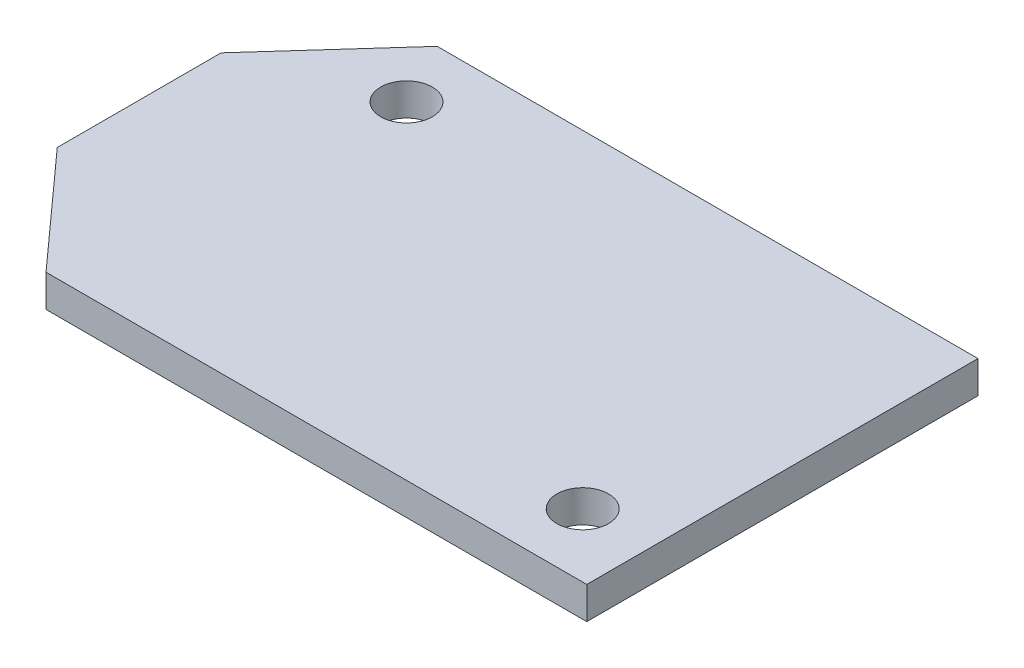
ISO-10303-21;
HEADER;
FILE_DESCRIPTION(('STEP AP214'),'2;1');
FILE_NAME('part.step','',(''),(''),'','','');
FILE_SCHEMA(('AUTOMOTIVE_DESIGN { 1 0 10303 214 1 1 1 1 }'));
ENDSEC;
DATA;
#1=APPLICATION_CONTEXT('core data for automotive mechanical design processes');
#2=APPLICATION_PROTOCOL_DEFINITION('international standard','automotive_design',2000,#1);
#3=PRODUCT_CONTEXT('',#1,'mechanical');
#4=PRODUCT('Part','Part','',(#3));
#5=PRODUCT_RELATED_PRODUCT_CATEGORY('part','',(#4));
#6=PRODUCT_DEFINITION_FORMATION('','',#4);
#7=PRODUCT_DEFINITION_CONTEXT('part definition',#1,'design');
#8=PRODUCT_DEFINITION('design','',#6,#7);
#9=PRODUCT_DEFINITION_SHAPE('','',#8);
#10=(LENGTH_UNIT() NAMED_UNIT(*) SI_UNIT(.MILLI.,.METRE.));
#11=(NAMED_UNIT(*) PLANE_ANGLE_UNIT() SI_UNIT($,.RADIAN.));
#12=(NAMED_UNIT(*) SI_UNIT($,.STERADIAN.) SOLID_ANGLE_UNIT());
#13=UNCERTAINTY_MEASURE_WITH_UNIT(LENGTH_MEASURE(1.E-05),#10,'distance_accuracy_value','');
#14=(GEOMETRIC_REPRESENTATION_CONTEXT(3) GLOBAL_UNCERTAINTY_ASSIGNED_CONTEXT((#13)) GLOBAL_UNIT_ASSIGNED_CONTEXT((#10,
#11,#12)) REPRESENTATION_CONTEXT('',''));
#15=CARTESIAN_POINT('',(0.,0.,0.));
#16=DIRECTION('',(0.,0.,1.));
#17=DIRECTION('',(1.,0.,0.));
#18=AXIS2_PLACEMENT_3D('',#15,#16,#17);
#19=CARTESIAN_POINT('',(0.,2.,0.));
#20=DIRECTION('',(0.,-1.,0.));
#21=DIRECTION('',(0.,0.,-1.));
#22=AXIS2_PLACEMENT_3D('',#19,#20,#21);
#23=PLANE('',#22);
#24=DIRECTION('',(0.,0.,-1.));
#25=VECTOR('',#24,1.);
#26=CARTESIAN_POINT('',(16.764,2.,12.1285));
#27=LINE('',#26,#25);
#28=CARTESIAN_POINT('',(16.764,2.,12.1285));
#29=VERTEX_POINT('',#28);
#30=CARTESIAN_POINT('',(16.764,2.,-12.1285));
#31=VERTEX_POINT('',#30);
#32=EDGE_CURVE('E146',#29,#31,#27,.T.);
#33=ORIENTED_EDGE('',*,*,#32,.T.);
#34=DIRECTION('',(-1.,0.,0.));
#35=VECTOR('',#34,1.);
#36=CARTESIAN_POINT('',(-16.764,2.,-12.1285));
#37=LINE('',#36,#35);
#38=CARTESIAN_POINT('',(-16.764,2.,-12.1285));
#39=VERTEX_POINT('',#38);
#40=EDGE_CURVE('E94',#31,#39,#37,.T.);
#41=ORIENTED_EDGE('',*,*,#40,.T.);
#42=DIRECTION('',(-0.669334446868794,0.,0.742961236024361));
#43=VECTOR('',#42,1.);
#44=CARTESIAN_POINT('',(-23.114,2.,-5.08));
#45=LINE('',#44,#43);
#46=CARTESIAN_POINT('',(-23.114,2.,-5.08));
#47=VERTEX_POINT('',#46);
#48=EDGE_CURVE('E107',#39,#47,#45,.T.);
#49=ORIENTED_EDGE('',*,*,#48,.T.);
#50=DIRECTION('',(0.,0.,1.));
#51=VECTOR('',#50,1.);
#52=CARTESIAN_POINT('',(-23.114,2.,5.08));
#53=LINE('',#52,#51);
#54=CARTESIAN_POINT('',(-23.114,2.,5.08));
#55=VERTEX_POINT('',#54);
#56=EDGE_CURVE('E101',#47,#55,#53,.T.);
#57=ORIENTED_EDGE('',*,*,#56,.T.);
#58=DIRECTION('',(0.669334446868794,0.,0.742961236024361));
#59=VECTOR('',#58,1.);
#60=CARTESIAN_POINT('',(-23.114,2.,5.08));
#61=LINE('',#60,#59);
#62=CARTESIAN_POINT('',(-16.764,2.,12.1285));
#63=VERTEX_POINT('',#62);
#64=EDGE_CURVE('E105',#55,#63,#61,.T.);
#65=ORIENTED_EDGE('',*,*,#64,.T.);
#66=DIRECTION('',(1.,0.,0.));
#67=VECTOR('',#66,1.);
#68=CARTESIAN_POINT('',(-16.764,2.,12.1285));
#69=LINE('',#68,#67);
#70=EDGE_CURVE('E57',#63,#29,#69,.T.);
#71=ORIENTED_EDGE('',*,*,#70,.T.);
#72=EDGE_LOOP('',(#33,#41,#49,#57,#65,#71));
#73=FACE_BOUND('',#72,.T.);
#74=CARTESIAN_POINT('',(12.574,2.,8.1915));
#75=DIRECTION('',(0.,1.,0.));
#76=DIRECTION('',(0.,0.,1.));
#77=AXIS2_PLACEMENT_3D('',#74,#75,#76);
#78=CIRCLE('',#77,1.6);
#79=CARTESIAN_POINT('',(12.574,2.,9.7915));
#80=VERTEX_POINT('',#79);
#81=EDGE_CURVE('E134',#80,#80,#78,.T.);
#82=ORIENTED_EDGE('',*,*,#81,.F.);
#83=EDGE_LOOP('',(#82));
#84=FACE_BOUND('',#83,.T.);
#85=CARTESIAN_POINT('',(-14.732,2.,-8.1915));
#86=DIRECTION('',(0.,1.,0.));
#87=DIRECTION('',(0.,0.,1.));
#88=AXIS2_PLACEMENT_3D('',#85,#86,#87);
#89=CIRCLE('',#88,1.6);
#90=CARTESIAN_POINT('',(-14.732,2.,-6.5915));
#91=VERTEX_POINT('',#90);
#92=EDGE_CURVE('E191',#91,#91,#89,.T.);
#93=ORIENTED_EDGE('',*,*,#92,.F.);
#94=EDGE_LOOP('',(#93));
#95=FACE_BOUND('',#94,.T.);
#96=ADVANCED_FACE('F39',(#73,#84,#95),#23,.F.);
#97=CARTESIAN_POINT('',(0.,0.,0.));
#98=DIRECTION('',(0.,-1.,0.));
#99=DIRECTION('',(0.,0.,-1.));
#100=AXIS2_PLACEMENT_3D('',#97,#98,#99);
#101=PLANE('',#100);
#102=CARTESIAN_POINT('',(12.574,0.,8.1915));
#103=DIRECTION('',(0.,1.,0.));
#104=DIRECTION('',(0.,0.,1.));
#105=AXIS2_PLACEMENT_3D('',#102,#103,#104);
#106=CIRCLE('',#105,1.6);
#107=CARTESIAN_POINT('',(12.574,0.,9.7915));
#108=VERTEX_POINT('',#107);
#109=EDGE_CURVE('E198',#108,#108,#106,.T.);
#110=ORIENTED_EDGE('',*,*,#109,.T.);
#111=EDGE_LOOP('',(#110));
#112=FACE_BOUND('',#111,.T.);
#113=DIRECTION('',(0.,0.,-1.));
#114=VECTOR('',#113,1.);
#115=CARTESIAN_POINT('',(16.764,0.,12.1285));
#116=LINE('',#115,#114);
#117=CARTESIAN_POINT('',(16.764,0.,12.1285));
#118=VERTEX_POINT('',#117);
#119=CARTESIAN_POINT('',(16.764,0.,-12.1285));
#120=VERTEX_POINT('',#119);
#121=EDGE_CURVE('E129',#118,#120,#116,.T.);
#122=ORIENTED_EDGE('',*,*,#121,.F.);
#123=DIRECTION('',(1.,0.,0.));
#124=VECTOR('',#123,1.);
#125=CARTESIAN_POINT('',(-16.764,0.,12.1285));
#126=LINE('',#125,#124);
#127=CARTESIAN_POINT('',(-16.764,0.,12.1285));
#128=VERTEX_POINT('',#127);
#129=EDGE_CURVE('E86',#128,#118,#126,.T.);
#130=ORIENTED_EDGE('',*,*,#129,.F.);
#131=DIRECTION('',(0.669334446868794,0.,0.742961236024361));
#132=VECTOR('',#131,1.);
#133=CARTESIAN_POINT('',(-23.114,0.,5.08));
#134=LINE('',#133,#132);
#135=CARTESIAN_POINT('',(-23.114,0.,5.08));
#136=VERTEX_POINT('',#135);
#137=EDGE_CURVE('E80',#136,#128,#134,.T.);
#138=ORIENTED_EDGE('',*,*,#137,.F.);
#139=DIRECTION('',(0.,0.,1.));
#140=VECTOR('',#139,1.);
#141=CARTESIAN_POINT('',(-23.114,0.,5.08));
#142=LINE('',#141,#140);
#143=CARTESIAN_POINT('',(-23.114,0.,-5.08));
#144=VERTEX_POINT('',#143);
#145=EDGE_CURVE('E116',#144,#136,#142,.T.);
#146=ORIENTED_EDGE('',*,*,#145,.F.);
#147=DIRECTION('',(-0.669334446868794,0.,0.742961236024361));
#148=VECTOR('',#147,1.);
#149=CARTESIAN_POINT('',(-23.114,0.,-5.08));
#150=LINE('',#149,#148);
#151=CARTESIAN_POINT('',(-16.764,0.,-12.1285));
#152=VERTEX_POINT('',#151);
#153=EDGE_CURVE('E137',#152,#144,#150,.T.);
#154=ORIENTED_EDGE('',*,*,#153,.F.);
#155=DIRECTION('',(-1.,0.,0.));
#156=VECTOR('',#155,1.);
#157=CARTESIAN_POINT('',(-16.764,0.,-12.1285));
#158=LINE('',#157,#156);
#159=EDGE_CURVE('E133',#120,#152,#158,.T.);
#160=ORIENTED_EDGE('',*,*,#159,.F.);
#161=EDGE_LOOP('',(#122,#130,#138,#146,#154,#160));
#162=FACE_BOUND('',#161,.T.);
#163=CARTESIAN_POINT('',(-14.732,0.,-8.1915));
#164=DIRECTION('',(0.,1.,0.));
#165=DIRECTION('',(0.,0.,1.));
#166=AXIS2_PLACEMENT_3D('',#163,#164,#165);
#167=CIRCLE('',#166,1.6);
#168=CARTESIAN_POINT('',(-14.732,0.,-6.5915));
#169=VERTEX_POINT('',#168);
#170=EDGE_CURVE('E194',#169,#169,#167,.T.);
#171=ORIENTED_EDGE('',*,*,#170,.T.);
#172=EDGE_LOOP('',(#171));
#173=FACE_BOUND('',#172,.T.);
#174=ADVANCED_FACE('F159',(#112,#162,#173),#101,.T.);
#175=CARTESIAN_POINT('',(16.764,2.,12.1285));
#176=DIRECTION('',(-1.,0.,0.));
#177=DIRECTION('',(0.,0.,1.));
#178=AXIS2_PLACEMENT_3D('',#175,#176,#177);
#179=PLANE('',#178);
#180=ORIENTED_EDGE('',*,*,#121,.T.);
#181=DIRECTION('',(0.,-1.,0.));
#182=VECTOR('',#181,1.);
#183=CARTESIAN_POINT('',(16.764,2.,-12.1285));
#184=LINE('',#183,#182);
#185=EDGE_CURVE('E11',#31,#120,#184,.T.);
#186=ORIENTED_EDGE('',*,*,#185,.F.);
#187=ORIENTED_EDGE('',*,*,#32,.F.);
#188=DIRECTION('',(0.,-1.,0.));
#189=VECTOR('',#188,1.);
#190=CARTESIAN_POINT('',(16.764,2.,12.1285));
#191=LINE('',#190,#189);
#192=EDGE_CURVE('E125',#29,#118,#191,.T.);
#193=ORIENTED_EDGE('',*,*,#192,.T.);
#194=EDGE_LOOP('',(#180,#186,#187,#193));
#195=FACE_BOUND('',#194,.T.);
#196=ADVANCED_FACE('F41',(#195),#179,.F.);
#197=CARTESIAN_POINT('',(-16.764,2.,-12.1285));
#198=DIRECTION('',(0.,0.,1.));
#199=DIRECTION('',(1.,0.,0.));
#200=AXIS2_PLACEMENT_3D('',#197,#198,#199);
#201=PLANE('',#200);
#202=ORIENTED_EDGE('',*,*,#159,.T.);
#203=DIRECTION('',(0.,-1.,0.));
#204=VECTOR('',#203,1.);
#205=CARTESIAN_POINT('',(-16.764,2.,-12.1285));
#206=LINE('',#205,#204);
#207=EDGE_CURVE('E49',#39,#152,#206,.T.);
#208=ORIENTED_EDGE('',*,*,#207,.F.);
#209=ORIENTED_EDGE('',*,*,#40,.F.);
#210=ORIENTED_EDGE('',*,*,#185,.T.);
#211=EDGE_LOOP('',(#202,#208,#209,#210));
#212=FACE_BOUND('',#211,.T.);
#213=ADVANCED_FACE('F246',(#212),#201,.F.);
#214=CARTESIAN_POINT('',(-23.114,2.,-5.08));
#215=DIRECTION('',(0.742961236024361,0.,0.669334446868794));
#216=DIRECTION('',(0.669334446868794,0.,-0.742961236024361));
#217=AXIS2_PLACEMENT_3D('',#214,#215,#216);
#218=PLANE('',#217);
#219=ORIENTED_EDGE('',*,*,#153,.T.);
#220=DIRECTION('',(0.,-1.,0.));
#221=VECTOR('',#220,1.);
#222=CARTESIAN_POINT('',(-23.114,2.,-5.08));
#223=LINE('',#222,#221);
#224=EDGE_CURVE('E118',#47,#144,#223,.T.);
#225=ORIENTED_EDGE('',*,*,#224,.F.);
#226=ORIENTED_EDGE('',*,*,#48,.F.);
#227=ORIENTED_EDGE('',*,*,#207,.T.);
#228=EDGE_LOOP('',(#219,#225,#226,#227));
#229=FACE_BOUND('',#228,.T.);
#230=ADVANCED_FACE('F156',(#229),#218,.F.);
#231=CARTESIAN_POINT('',(-23.114,2.,5.08));
#232=DIRECTION('',(1.,0.,0.));
#233=DIRECTION('',(0.,0.,-1.));
#234=AXIS2_PLACEMENT_3D('',#231,#232,#233);
#235=PLANE('',#234);
#236=ORIENTED_EDGE('',*,*,#145,.T.);
#237=DIRECTION('',(0.,-1.,0.));
#238=VECTOR('',#237,1.);
#239=CARTESIAN_POINT('',(-23.114,2.,5.08));
#240=LINE('',#239,#238);
#241=EDGE_CURVE('E113',#55,#136,#240,.T.);
#242=ORIENTED_EDGE('',*,*,#241,.F.);
#243=ORIENTED_EDGE('',*,*,#56,.F.);
#244=ORIENTED_EDGE('',*,*,#224,.T.);
#245=EDGE_LOOP('',(#236,#242,#243,#244));
#246=FACE_BOUND('',#245,.T.);
#247=ADVANCED_FACE('F114',(#246),#235,.F.);
#248=CARTESIAN_POINT('',(-23.114,2.,5.08));
#249=DIRECTION('',(0.742961236024361,0.,-0.669334446868794));
#250=DIRECTION('',(-0.669334446868794,0.,-0.742961236024361));
#251=AXIS2_PLACEMENT_3D('',#248,#249,#250);
#252=PLANE('',#251);
#253=ORIENTED_EDGE('',*,*,#137,.T.);
#254=DIRECTION('',(0.,-1.,0.));
#255=VECTOR('',#254,1.);
#256=CARTESIAN_POINT('',(-16.764,2.,12.1285));
#257=LINE('',#256,#255);
#258=EDGE_CURVE('E119',#63,#128,#257,.T.);
#259=ORIENTED_EDGE('',*,*,#258,.F.);
#260=ORIENTED_EDGE('',*,*,#64,.F.);
#261=ORIENTED_EDGE('',*,*,#241,.T.);
#262=EDGE_LOOP('',(#253,#259,#260,#261));
#263=FACE_BOUND('',#262,.T.);
#264=ADVANCED_FACE('F121',(#263),#252,.F.);
#265=CARTESIAN_POINT('',(-16.764,2.,12.1285));
#266=DIRECTION('',(0.,0.,-1.));
#267=DIRECTION('',(-1.,0.,0.));
#268=AXIS2_PLACEMENT_3D('',#265,#266,#267);
#269=PLANE('',#268);
#270=ORIENTED_EDGE('',*,*,#129,.T.);
#271=ORIENTED_EDGE('',*,*,#192,.F.);
#272=ORIENTED_EDGE('',*,*,#70,.F.);
#273=ORIENTED_EDGE('',*,*,#258,.T.);
#274=EDGE_LOOP('',(#270,#271,#272,#273));
#275=FACE_BOUND('',#274,.T.);
#276=ADVANCED_FACE('F164',(#275),#269,.F.);
#277=CARTESIAN_POINT('',(12.574,2.,8.1915));
#278=DIRECTION('',(0.,-1.,0.));
#279=DIRECTION('',(0.,0.,-1.));
#280=AXIS2_PLACEMENT_3D('',#277,#278,#279);
#281=CYLINDRICAL_SURFACE('',#280,1.6);
#282=ORIENTED_EDGE('',*,*,#81,.T.);
#283=EDGE_LOOP('',(#282));
#284=FACE_BOUND('',#283,.T.);
#285=ORIENTED_EDGE('',*,*,#109,.F.);
#286=EDGE_LOOP('',(#285));
#287=FACE_BOUND('',#286,.T.);
#288=ADVANCED_FACE('F166',(#284,#287),#281,.F.);
#289=CARTESIAN_POINT('',(-14.732,2.,-8.1915));
#290=DIRECTION('',(0.,-1.,0.));
#291=DIRECTION('',(0.,0.,-1.));
#292=AXIS2_PLACEMENT_3D('',#289,#290,#291);
#293=CYLINDRICAL_SURFACE('',#292,1.6);
#294=ORIENTED_EDGE('',*,*,#92,.T.);
#295=EDGE_LOOP('',(#294));
#296=FACE_BOUND('',#295,.T.);
#297=ORIENTED_EDGE('',*,*,#170,.F.);
#298=EDGE_LOOP('',(#297));
#299=FACE_BOUND('',#298,.T.);
#300=ADVANCED_FACE('F172',(#296,#299),#293,.F.);
#301=CLOSED_SHELL('',(#96,#174,#196,#213,#230,#247,#264,#276,#288,#300));
#302=MANIFOLD_SOLID_BREP('B2',#301);
#303=ADVANCED_BREP_SHAPE_REPRESENTATION('',(#18,#302),#14);
#304=SHAPE_DEFINITION_REPRESENTATION(#9,#303);
ENDSEC;
END-ISO-10303-21;
